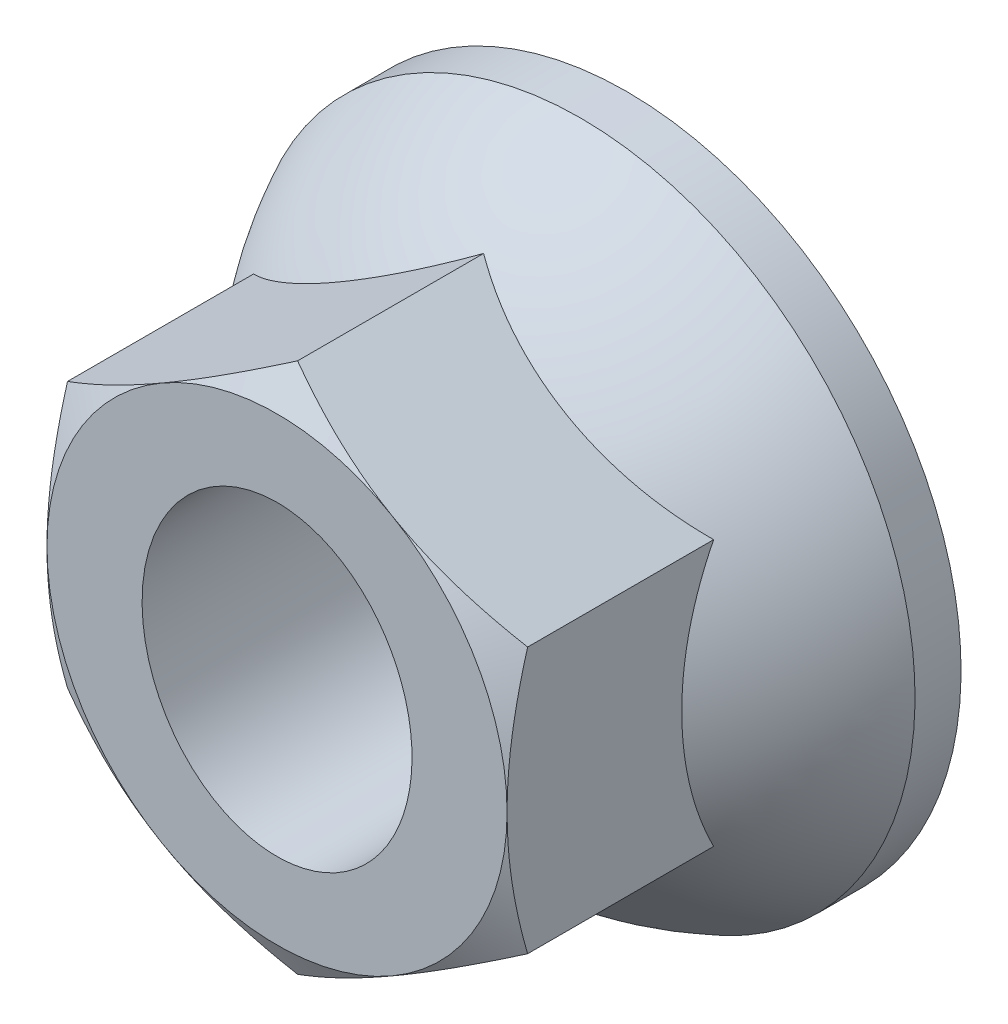
ISO-10303-21;
HEADER;
FILE_DESCRIPTION(('STEP AP214'),'2;1');
FILE_NAME('part.step','',(''),(''),'','','');
FILE_SCHEMA(('AUTOMOTIVE_DESIGN { 1 0 10303 214 1 1 1 1 }'));
ENDSEC;
DATA;
#1=APPLICATION_CONTEXT('core data for automotive mechanical design processes');
#2=APPLICATION_PROTOCOL_DEFINITION('international standard','automotive_design',2000,#1);
#3=PRODUCT_CONTEXT('',#1,'mechanical');
#4=PRODUCT('Part','Part','',(#3));
#5=PRODUCT_RELATED_PRODUCT_CATEGORY('part','',(#4));
#6=PRODUCT_DEFINITION_FORMATION('','',#4);
#7=PRODUCT_DEFINITION_CONTEXT('part definition',#1,'design');
#8=PRODUCT_DEFINITION('design','',#6,#7);
#9=PRODUCT_DEFINITION_SHAPE('','',#8);
#10=(LENGTH_UNIT() NAMED_UNIT(*) SI_UNIT(.MILLI.,.METRE.));
#11=(NAMED_UNIT(*) PLANE_ANGLE_UNIT() SI_UNIT($,.RADIAN.));
#12=(NAMED_UNIT(*) SI_UNIT($,.STERADIAN.) SOLID_ANGLE_UNIT());
#13=UNCERTAINTY_MEASURE_WITH_UNIT(LENGTH_MEASURE(1.E-05),#10,'distance_accuracy_value','');
#14=(GEOMETRIC_REPRESENTATION_CONTEXT(3) GLOBAL_UNCERTAINTY_ASSIGNED_CONTEXT((#13)) GLOBAL_UNIT_ASSIGNED_CONTEXT((#10,
#11,#12)) REPRESENTATION_CONTEXT('',''));
#15=CARTESIAN_POINT('',(0.,0.,0.));
#16=DIRECTION('',(0.,0.,1.));
#17=DIRECTION('',(1.,0.,0.));
#18=AXIS2_PLACEMENT_3D('',#15,#16,#17);
#19=CARTESIAN_POINT('',(7.5,-4.3301270189222,-5.7));
#20=DIRECTION('',(0.,0.,1.));
#21=DIRECTION('',(1.,0.,0.));
#22=AXIS2_PLACEMENT_3D('',#19,#20,#21);
#23=PLANE('',#22);
#24=CARTESIAN_POINT('',(0.,0.,-5.7));
#25=DIRECTION('',(0.,0.,-1.));
#26=DIRECTION('',(0.,1.,0.));
#27=AXIS2_PLACEMENT_3D('',#24,#25,#26);
#28=CIRCLE('',#27,10.9);
#29=CARTESIAN_POINT('',(0.,10.9,-5.7));
#30=VERTEX_POINT('',#29);
#31=EDGE_CURVE('E234',#30,#30,#28,.T.);
#32=ORIENTED_EDGE('',*,*,#31,.T.);
#33=EDGE_LOOP('',(#32));
#34=FACE_BOUND('',#33,.T.);
#35=CARTESIAN_POINT('',(0.,0.,-5.7));
#36=DIRECTION('',(0.,0.,1.));
#37=DIRECTION('',(0.,1.,0.));
#38=AXIS2_PLACEMENT_3D('',#35,#36,#37);
#39=ELLIPSE('',#38,5.,4.4);
#40=CARTESIAN_POINT('',(0.,5.,-5.7));
#41=VERTEX_POINT('',#40);
#42=EDGE_CURVE('E133',#41,#41,#39,.F.);
#43=ORIENTED_EDGE('',*,*,#42,.F.);
#44=EDGE_LOOP('',(#43));
#45=FACE_BOUND('',#44,.T.);
#46=ADVANCED_FACE('F38',(#34,#45),#23,.F.);
#47=CARTESIAN_POINT('',(7.5,-4.3301270189222,5.7));
#48=DIRECTION('',(0.,0.,1.));
#49=DIRECTION('',(1.,0.,0.));
#50=AXIS2_PLACEMENT_3D('',#47,#48,#49);
#51=PLANE('',#50);
#52=CARTESIAN_POINT('',(0.,0.,5.7));
#53=DIRECTION('',(0.,0.,1.));
#54=DIRECTION('',(1.,0.,0.));
#55=AXIS2_PLACEMENT_3D('',#52,#53,#54);
#56=CIRCLE('',#55,7.5);
#57=CARTESIAN_POINT('',(3.75,-6.49519052838329,5.7));
#58=VERTEX_POINT('',#57);
#59=CARTESIAN_POINT('',(7.5,0.,5.7));
#60=VERTEX_POINT('',#59);
#61=EDGE_CURVE('E43',#58,#60,#56,.T.);
#62=ORIENTED_EDGE('',*,*,#61,.T.);
#63=CARTESIAN_POINT('',(0.,0.,5.7));
#64=DIRECTION('',(0.,0.,1.));
#65=DIRECTION('',(1.,0.,0.));
#66=AXIS2_PLACEMENT_3D('',#63,#64,#65);
#67=CIRCLE('',#66,7.5);
#68=CARTESIAN_POINT('',(3.75,6.49519052838329,5.7));
#69=VERTEX_POINT('',#68);
#70=EDGE_CURVE('E55',#60,#69,#67,.T.);
#71=ORIENTED_EDGE('',*,*,#70,.T.);
#72=CARTESIAN_POINT('',(-3.75,6.49519052838329,5.7));
#73=VERTEX_POINT('',#72);
#74=EDGE_CURVE('E12',#69,#73,#56,.T.);
#75=ORIENTED_EDGE('',*,*,#74,.T.);
#76=CARTESIAN_POINT('',(-7.5,0.,5.7));
#77=VERTEX_POINT('',#76);
#78=EDGE_CURVE('E48',#73,#77,#56,.T.);
#79=ORIENTED_EDGE('',*,*,#78,.T.);
#80=CARTESIAN_POINT('',(-3.75,-6.49519052838329,5.7));
#81=VERTEX_POINT('',#80);
#82=EDGE_CURVE('E63',#77,#81,#56,.T.);
#83=ORIENTED_EDGE('',*,*,#82,.T.);
#84=EDGE_CURVE('E266',#81,#58,#56,.T.);
#85=ORIENTED_EDGE('',*,*,#84,.T.);
#86=EDGE_LOOP('',(#62,#71,#75,#79,#83,#85));
#87=FACE_BOUND('',#86,.T.);
#88=CARTESIAN_POINT('',(0.,0.,5.7));
#89=DIRECTION('',(0.,0.,1.));
#90=DIRECTION('',(0.,1.,0.));
#91=AXIS2_PLACEMENT_3D('',#88,#89,#90);
#92=ELLIPSE('',#91,5.,4.4);
#93=CARTESIAN_POINT('',(0.,5.,5.7));
#94=VERTEX_POINT('',#93);
#95=EDGE_CURVE('E398',#94,#94,#92,.T.);
#96=ORIENTED_EDGE('',*,*,#95,.F.);
#97=EDGE_LOOP('',(#96));
#98=FACE_BOUND('',#97,.T.);
#99=ADVANCED_FACE('F129',(#87,#98),#51,.T.);
#100=CARTESIAN_POINT('',(0.,-8.66025403784439,5.7));
#101=DIRECTION('',(-0.5,0.866025403784439,0.));
#102=DIRECTION('',(-0.866025403784439,-0.5,0.));
#103=AXIS2_PLACEMENT_3D('',#100,#101,#102);
#104=PLANE('',#103);
#105=CARTESIAN_POINT('',(3.75,-6.49519052838329,-9.5360294117647));
#106=DIRECTION('',(-0.5,0.866025403784439,0.));
#107=DIRECTION('',(-0.866025403784439,-0.5,0.));
#108=AXIS2_PLACEMENT_3D('',#105,#106,#107);
#109=CIRCLE('',#108,9.54113252623702);
#110=CARTESIAN_POINT('',(0.,-8.66025403784439,-1.0340761136562));
#111=VERTEX_POINT('',#110);
#112=CARTESIAN_POINT('',(7.5,-4.3301270189222,-1.03407611365621));
#113=VERTEX_POINT('',#112);
#114=EDGE_CURVE('E246',#111,#113,#109,.T.);
#115=ORIENTED_EDGE('',*,*,#114,.T.);
#116=DIRECTION('',(0.,0.,-1.));
#117=VECTOR('',#116,1.);
#118=CARTESIAN_POINT('',(7.5,-4.3301270189222,5.7));
#119=LINE('',#118,#117);
#120=CARTESIAN_POINT('',(7.5,-4.33012701892243,5.03012701892235));
#121=VERTEX_POINT('',#120);
#122=EDGE_CURVE('E260',#121,#113,#119,.T.);
#123=ORIENTED_EDGE('',*,*,#122,.F.);
#124=CARTESIAN_POINT('',(-0.000200000000000411,-8.66036950789822,5.03006035092221));
#125=CARTESIAN_POINT('',(0.164658347528303,-8.5651884965746,5.08500472895377));
#126=CARTESIAN_POINT('',(0.330131366574374,-8.46965260448473,5.13745551258067));
#127=CARTESIAN_POINT('',(0.662421221390856,-8.27780496735746,5.2366831074677));
#128=CARTESIAN_POINT('',(0.829238604021478,-8.18149290659016,5.28345747105412));
#129=CARTESIAN_POINT('',(1.33236168864788,-7.89101465824559,5.41434781674883));
#130=CARTESIAN_POINT('',(1.67065338263293,-7.69570185765871,5.48879669332343));
#131=CARTESIAN_POINT('',(2.17690074399285,-7.40341980730102,5.57609667073379));
#132=CARTESIAN_POINT('',(2.34334381202516,-7.30732385716782,5.60096588667846));
#133=CARTESIAN_POINT('',(2.67698200759169,-7.11469775514554,5.64266788572599));
#134=CARTESIAN_POINT('',(2.84417706735965,-7.01816764238133,5.65950137888585));
#135=CARTESIAN_POINT('',(3.17885756076865,-6.82493976941913,5.68470292592581));
#136=CARTESIAN_POINT('',(3.34634244781307,-6.72824232479884,5.69308058697982));
#137=CARTESIAN_POINT('',(3.68145767904924,-6.53476345583509,5.70119981902506));
#138=CARTESIAN_POINT('',(3.84908801858729,-6.43798203417845,5.70094165681687));
#139=CARTESIAN_POINT('',(4.30833780194545,-6.17283404813135,5.68836399486338));
#140=CARTESIAN_POINT('',(4.59980690473784,-6.0045542831737,5.66725033231931));
#141=CARTESIAN_POINT('',(5.18080920194341,-5.66911245048227,5.60029942126457));
#142=CARTESIAN_POINT('',(5.47034035314774,-5.50195156239567,5.55443929053726));
#143=CARTESIAN_POINT('',(6.05251186318613,-5.16583468436048,5.43980254355176));
#144=CARTESIAN_POINT('',(6.34507876500837,-4.99692110483743,5.37054023563082));
#145=CARTESIAN_POINT('',(6.92584963394653,-4.66161288731849,5.21334284742308));
#146=CARTESIAN_POINT('',(7.2140610384998,-4.49521395531614,5.1254446908316));
#147=CARTESIAN_POINT('',(7.5002,-4.33001154886836,5.03006035092221));
#148=B_SPLINE_CURVE_WITH_KNOTS('',3,(#124,#125,#126,#127,#128,#129,#130,#131,#132,#133,#134,
#135,#136,#137,#138,#139,#140,#141,#142,#143,#144,#145,#146,#147),.UNSPECIFIED.,.F.,.F.,(4,2,2,
2,2,2,2,2,2,2,2,4),(0.,0.594350768035413,1.1889569164522,2.38063993230779,2.96188692500078,
3.54308254771242,4.12361709366648,4.70413370423531,5.71473675578131,6.7262758828811,
7.7602492531408,8.79219281633469),.UNSPECIFIED.);
#149=EDGE_CURVE('E174',#58,#121,#148,.T.);
#150=ORIENTED_EDGE('',*,*,#149,.F.);
#151=CARTESIAN_POINT('',(0.,-8.66025403784439,5.0301270189222));
#152=VERTEX_POINT('',#151);
#153=EDGE_CURVE('E239',#152,#58,#148,.T.);
#154=ORIENTED_EDGE('',*,*,#153,.F.);
#155=DIRECTION('',(0.,0.,-1.));
#156=VECTOR('',#155,1.);
#157=CARTESIAN_POINT('',(0.,-8.66025403784439,5.7));
#158=LINE('',#157,#156);
#159=EDGE_CURVE('E248',#152,#111,#158,.T.);
#160=ORIENTED_EDGE('',*,*,#159,.T.);
#161=EDGE_LOOP('',(#115,#123,#150,#154,#160));
#162=FACE_BOUND('',#161,.T.);
#163=ADVANCED_FACE('F40',(#162),#104,.F.);
#164=CARTESIAN_POINT('',(7.5,-4.3301270189222,5.7));
#165=DIRECTION('',(-1.,0.,0.));
#166=DIRECTION('',(0.,-1.,0.));
#167=AXIS2_PLACEMENT_3D('',#164,#165,#166);
#168=PLANE('',#167);
#169=CARTESIAN_POINT('',(7.5,0.,-9.5360294117647));
#170=DIRECTION('',(-1.,0.,0.));
#171=DIRECTION('',(0.,-1.,0.));
#172=AXIS2_PLACEMENT_3D('',#169,#170,#171);
#173=CIRCLE('',#172,9.54113252623702);
#174=CARTESIAN_POINT('',(7.5,4.3301270189222,-1.0340761136562));
#175=VERTEX_POINT('',#174);
#176=EDGE_CURVE('E244',#113,#175,#173,.T.);
#177=ORIENTED_EDGE('',*,*,#176,.T.);
#178=DIRECTION('',(0.,0.,-1.));
#179=VECTOR('',#178,1.);
#180=CARTESIAN_POINT('',(7.5,4.3301270189222,5.7));
#181=LINE('',#180,#179);
#182=CARTESIAN_POINT('',(7.5,4.3301270189222,5.03012701892219));
#183=VERTEX_POINT('',#182);
#184=EDGE_CURVE('E258',#183,#175,#181,.T.);
#185=ORIENTED_EDGE('',*,*,#184,.F.);
#186=CARTESIAN_POINT('',(7.5,-11.8624678338848,1.92728506666141));
#187=CARTESIAN_POINT('',(7.5,-11.5328457376214,2.08809744117027));
#188=CARTESIAN_POINT('',(7.5,-11.2024912853407,2.24743321529681));
#189=CARTESIAN_POINT('',(7.5,-10.5399289565581,2.56232533562342));
#190=CARTESIAN_POINT('',(7.5,-10.2077208171779,2.717881128111));
#191=CARTESIAN_POINT('',(7.5,-9.53945946788294,3.02512073818121));
#192=CARTESIAN_POINT('',(7.5,-9.20339529022096,3.17678077913414));
#193=CARTESIAN_POINT('',(7.5,-8.52867329930982,3.47419467429847));
#194=CARTESIAN_POINT('',(7.5,-8.19001560305681,3.61994879308739));
#195=CARTESIAN_POINT('',(7.5,-7.49786360718472,3.90888491917955));
#196=CARTESIAN_POINT('',(7.5,-7.14425974861481,4.05180586766548));
#197=CARTESIAN_POINT('',(7.5,-6.43300236260634,4.32738020491684));
#198=CARTESIAN_POINT('',(7.5,-6.07534839863684,4.46003247458771));
#199=CARTESIAN_POINT('',(7.5,-5.3560150262996,4.71175565610245));
#200=CARTESIAN_POINT('',(7.5,-4.99434466734429,4.83085216023722));
#201=CARTESIAN_POINT('',(7.5,-4.26583379083137,5.05179729592312));
#202=CARTESIAN_POINT('',(7.5,-3.8989948659867,5.15365112017604));
#203=CARTESIAN_POINT('',(7.5,-3.16192086951898,5.33482975886738));
#204=CARTESIAN_POINT('',(7.5,-2.79171811431998,5.41428259020064));
#205=CARTESIAN_POINT('',(7.5,-2.23286584461635,5.51333570146998));
#206=CARTESIAN_POINT('',(7.5,-2.04597858174939,5.5430002768522));
#207=CARTESIAN_POINT('',(7.5,-1.67119867125142,5.59504538851882));
#208=CARTESIAN_POINT('',(7.5,-1.4833061232766,5.61742663369904));
#209=CARTESIAN_POINT('',(7.5,-1.10932231055302,5.65416584975736));
#210=CARTESIAN_POINT('',(7.5,-0.923241432591073,5.6686290917487));
#211=CARTESIAN_POINT('',(7.5,-0.550634001123204,5.6896652282327));
#212=CARTESIAN_POINT('',(7.5,-0.364107455445952,5.69623826031976));
#213=CARTESIAN_POINT('',(7.5,0.00905823476357524,5.70133605454041));
#214=CARTESIAN_POINT('',(7.5,0.195697379759309,5.69986078331806));
#215=CARTESIAN_POINT('',(7.5,0.568742366438614,5.6889003395425));
#216=CARTESIAN_POINT('',(7.5,0.755148197384577,5.67941481099973));
#217=CARTESIAN_POINT('',(7.5,1.19625328292009,5.64769661141222));
#218=CARTESIAN_POINT('',(7.5,1.45071264523352,5.62204693053427));
#219=CARTESIAN_POINT('',(7.5,1.95788025873181,5.55716915064197));
#220=CARTESIAN_POINT('',(7.5,2.21058829297697,5.51793939905958));
#221=CARTESIAN_POINT('',(7.5,2.96571213846647,5.38194915581682));
#222=CARTESIAN_POINT('',(7.5,3.46488700839563,5.26690739114848));
#223=CARTESIAN_POINT('',(7.5,4.21175910897805,5.06562643164791));
#224=CARTESIAN_POINT('',(7.5,4.46327798189274,4.99273656829492));
#225=CARTESIAN_POINT('',(7.5,4.96387757889623,4.83894210496991));
#226=CARTESIAN_POINT('',(7.5,5.21295828362573,4.75803744141614));
#227=CARTESIAN_POINT('',(7.5,5.70875452435172,4.58954791755454));
#228=CARTESIAN_POINT('',(7.5,5.9554706741828,4.50196484690174));
#229=CARTESIAN_POINT('',(7.5,6.44682677730069,4.32119315346525));
#230=CARTESIAN_POINT('',(7.5,6.69146678230042,4.2280046707724));
#231=CARTESIAN_POINT('',(7.5,7.36246161814329,3.9650046907528));
#232=CARTESIAN_POINT('',(7.5,7.78691341159853,3.79034201244135));
#233=CARTESIAN_POINT('',(7.5,8.63131442401152,3.4304130048731));
#234=CARTESIAN_POINT('',(7.5,9.05126308940821,3.24514538931825));
#235=CARTESIAN_POINT('',(7.5,9.88771968583189,2.86657146619056));
#236=CARTESIAN_POINT('',(7.5,10.304226109548,2.67326183973855));
#237=CARTESIAN_POINT('',(7.5,11.1343338845794,2.28057132688068));
#238=CARTESIAN_POINT('',(7.5,11.5479353653164,2.08119071308959));
#239=CARTESIAN_POINT('',(7.5,12.373526814919,1.67736246439331));
#240=CARTESIAN_POINT('',(7.5,12.7855128308024,1.47290676546053));
#241=CARTESIAN_POINT('',(7.5,13.6076089200337,1.06025514091654));
#242=CARTESIAN_POINT('',(7.5,14.0177189760598,0.852059180856811));
#243=CARTESIAN_POINT('',(7.5,14.8363060491096,0.432725398715312));
#244=CARTESIAN_POINT('',(7.5,15.2447834348064,0.221588295448026));
#245=CARTESIAN_POINT('',(7.5,16.0604733961248,-0.203116490819916));
#246=CARTESIAN_POINT('',(7.5,16.4676859666126,-0.416684183669698));
#247=CARTESIAN_POINT('',(7.5,17.5987846667367,-1.01342749216833));
#248=CARTESIAN_POINT('',(7.5,18.3215327410963,-1.39875974788874));
#249=CARTESIAN_POINT('',(7.5,19.7646347588531,-2.17398683391115));
#250=CARTESIAN_POINT('',(7.5,20.484988537998,-2.56388196926437));
#251=CARTESIAN_POINT('',(7.5,21.9213150399891,-3.34568354245719));
#252=CARTESIAN_POINT('',(7.5,22.6372942568684,-3.73757805709041));
#253=CARTESIAN_POINT('',(7.5,23.7101694591332,-4.32733624897439));
#254=CARTESIAN_POINT('',(7.5,24.0675973985926,-4.52423347927221));
#255=CARTESIAN_POINT('',(7.5,24.7821368856686,-4.91860011589127));
#256=CARTESIAN_POINT('',(7.5,25.1392484337073,-5.1160695214475));
#257=CARTESIAN_POINT('',(7.5,25.4962213463683,-5.31378928845083));
#258=B_SPLINE_CURVE_WITH_KNOTS('',3,(#186,#187,#188,#189,#190,#191,#192,#193,#194,#195,#196,
#197,#198,#199,#200,#201,#202,#203,#204,#205,#206,#207,#208,#209,#210,#211,#212,#213,#214,#215,
#216,#217,#218,#219,#220,#221,#222,#223,#224,#225,#226,#227,#228,#229,#230,#231,#232,#233,#234,
#235,#236,#237,#238,#239,#240,#241,#242,#243,#244,#245,#246,#247,#248,#249,#250,#251,#252,#253,
#254,#255,#256,#257),.UNSPECIFIED.,.F.,.F.,(4,2,2,2,2,2,2,2,2,2,2,2,2,2,2,2,2,2,2,2,2,2,2,2,2,2,
2,2,2,2,2,2,2,2,2,4),(0.,1.1002860174317,2.20073225087718,3.30678744386493,4.41279303213297,
5.55685386575428,6.70103920565941,7.84302726390369,8.98467079371612,10.1196513376086,
10.68721271233,11.2547188290465,11.8144843404463,12.3742400901626,12.9339981597705,
13.4937811072962,14.260599324346,15.0275108888493,16.5620551990661,17.3475860316543,
18.1331230963895,18.9184503906132,19.7037580660324,21.0804916441742,22.4573925649098,
23.834867471808,25.2122806148121,26.5920436164986,27.9718193325907,29.3512635507415,
30.7307133606056,33.1878429886977,35.6451378373834,38.0937765695139,39.3179940081302,
40.5422098106952),.UNSPECIFIED.);
#259=EDGE_CURVE('E115',#60,#183,#258,.T.);
#260=ORIENTED_EDGE('',*,*,#259,.F.);
#261=EDGE_CURVE('E281',#121,#60,#258,.T.);
#262=ORIENTED_EDGE('',*,*,#261,.F.);
#263=ORIENTED_EDGE('',*,*,#122,.T.);
#264=EDGE_LOOP('',(#177,#185,#260,#262,#263));
#265=FACE_BOUND('',#264,.T.);
#266=ADVANCED_FACE('F211',(#265),#168,.F.);
#267=CARTESIAN_POINT('',(7.5,4.3301270189222,5.7));
#268=DIRECTION('',(-0.5,-0.866025403784438,0.));
#269=DIRECTION('',(0.866025403784439,-0.5,0.));
#270=AXIS2_PLACEMENT_3D('',#267,#268,#269);
#271=PLANE('',#270);
#272=CARTESIAN_POINT('',(3.75,6.49519052838329,-9.5360294117647));
#273=DIRECTION('',(-0.5,-0.866025403784438,0.));
#274=DIRECTION('',(0.866025403784439,-0.5,0.));
#275=AXIS2_PLACEMENT_3D('',#272,#273,#274);
#276=CIRCLE('',#275,9.54113252623702);
#277=CARTESIAN_POINT('',(0.,8.66025403784439,-1.0340761136562));
#278=VERTEX_POINT('',#277);
#279=EDGE_CURVE('E242',#175,#278,#276,.T.);
#280=ORIENTED_EDGE('',*,*,#279,.T.);
#281=DIRECTION('',(0.,0.,-1.));
#282=VECTOR('',#281,1.);
#283=CARTESIAN_POINT('',(0.,8.66025403784439,5.7));
#284=LINE('',#283,#282);
#285=CARTESIAN_POINT('',(0.,8.66025403784439,5.03012701892219));
#286=VERTEX_POINT('',#285);
#287=EDGE_CURVE('E138',#286,#278,#284,.T.);
#288=ORIENTED_EDGE('',*,*,#287,.F.);
#289=CARTESIAN_POINT('',(7.5002,4.33001154886836,5.03006035092221));
#290=CARTESIAN_POINT('',(7.33534165247169,4.42519256019198,5.08500472895377));
#291=CARTESIAN_POINT('',(7.16986863342562,4.52072845228185,5.13745551258067));
#292=CARTESIAN_POINT('',(6.83757877860914,4.71257608940913,5.2366831074677));
#293=CARTESIAN_POINT('',(6.67076139597852,4.80888815017643,5.28345747105412));
#294=CARTESIAN_POINT('',(6.16763831135212,5.09936639852099,5.41434781674883));
#295=CARTESIAN_POINT('',(5.82934661736707,5.29467919910788,5.48879669332343));
#296=CARTESIAN_POINT('',(5.32309925600715,5.58696124946557,5.57609667073378));
#297=CARTESIAN_POINT('',(5.15665618797484,5.68305719959877,5.60096588667846));
#298=CARTESIAN_POINT('',(4.8230179924083,5.87568330162105,5.64266788572599));
#299=CARTESIAN_POINT('',(4.65582293264035,5.97221341438525,5.65950137888585));
#300=CARTESIAN_POINT('',(4.32114243923135,6.16544128734746,5.6847029259258));
#301=CARTESIAN_POINT('',(4.15365755218693,6.26213873196775,5.69308058697982));
#302=CARTESIAN_POINT('',(3.81854232095076,6.45561760093149,5.70119981902505));
#303=CARTESIAN_POINT('',(3.65091198141271,6.55239902258814,5.70094165681687));
#304=CARTESIAN_POINT('',(3.19166219805455,6.81754700863524,5.68836399486338));
#305=CARTESIAN_POINT('',(2.90019309526215,6.98582677359289,5.66725033231931));
#306=CARTESIAN_POINT('',(2.31919079805659,7.32126860628432,5.60029942126456));
#307=CARTESIAN_POINT('',(2.02965964685226,7.48842949437092,5.55443929053725));
#308=CARTESIAN_POINT('',(1.44748813681387,7.82454637240611,5.43980254355176));
#309=CARTESIAN_POINT('',(1.15492123499162,7.99345995192916,5.37054023563082));
#310=CARTESIAN_POINT('',(0.574150366053471,8.3287681694481,5.21334284742308));
#311=CARTESIAN_POINT('',(0.285938961500197,8.49516710145045,5.1254446908316));
#312=CARTESIAN_POINT('',(-0.000199999999999066,8.66036950789823,5.03006035092221));
#313=B_SPLINE_CURVE_WITH_KNOTS('',3,(#289,#290,#291,#292,#293,#294,#295,#296,#297,#298,#299,
#300,#301,#302,#303,#304,#305,#306,#307,#308,#309,#310,#311,#312),.UNSPECIFIED.,.F.,.F.,(4,2,2,
2,2,2,2,2,2,2,2,4),(0.,0.594350768035412,1.1889569164522,2.38063993230779,2.96188692500078,
3.54308254771242,4.12361709366648,4.70413370423531,5.71473675578131,6.7262758828811,
7.7602492531408,8.79219281633469),.UNSPECIFIED.);
#314=EDGE_CURVE('E120',#69,#286,#313,.T.);
#315=ORIENTED_EDGE('',*,*,#314,.F.);
#316=EDGE_CURVE('E111',#183,#69,#313,.T.);
#317=ORIENTED_EDGE('',*,*,#316,.F.);
#318=ORIENTED_EDGE('',*,*,#184,.T.);
#319=EDGE_LOOP('',(#280,#288,#315,#317,#318));
#320=FACE_BOUND('',#319,.T.);
#321=ADVANCED_FACE('F136',(#320),#271,.F.);
#322=CARTESIAN_POINT('',(0.,8.66025403784439,5.7));
#323=DIRECTION('',(0.5,-0.866025403784439,0.));
#324=DIRECTION('',(0.866025403784439,0.5,0.));
#325=AXIS2_PLACEMENT_3D('',#322,#323,#324);
#326=PLANE('',#325);
#327=CARTESIAN_POINT('',(-3.75,6.49519052838329,-9.5360294117647));
#328=DIRECTION('',(0.5,-0.866025403784439,0.));
#329=DIRECTION('',(0.866025403784439,0.5,0.));
#330=AXIS2_PLACEMENT_3D('',#327,#328,#329);
#331=CIRCLE('',#330,9.54113252623702);
#332=CARTESIAN_POINT('',(-7.5,4.3301270189222,-1.03407611365621));
#333=VERTEX_POINT('',#332);
#334=EDGE_CURVE('E237',#278,#333,#331,.T.);
#335=ORIENTED_EDGE('',*,*,#334,.T.);
#336=DIRECTION('',(0.,0.,-1.));
#337=VECTOR('',#336,1.);
#338=CARTESIAN_POINT('',(-7.5,4.3301270189222,5.7));
#339=LINE('',#338,#337);
#340=CARTESIAN_POINT('',(-7.5,4.3301270189222,5.03012701892219));
#341=VERTEX_POINT('',#340);
#342=EDGE_CURVE('E254',#341,#333,#339,.T.);
#343=ORIENTED_EDGE('',*,*,#342,.F.);
#344=CARTESIAN_POINT('',(0.000200000000000658,8.66036950789823,5.03006035092221));
#345=CARTESIAN_POINT('',(-0.164658347528303,8.56518849657461,5.08500472895376));
#346=CARTESIAN_POINT('',(-0.330131366574374,8.46965260448474,5.13745551258067));
#347=CARTESIAN_POINT('',(-0.662421221390856,8.27780496735746,5.2366831074677));
#348=CARTESIAN_POINT('',(-0.829238604021478,8.18149290659016,5.28345747105412));
#349=CARTESIAN_POINT('',(-1.33236168864788,7.89101465824559,5.41434781674883));
#350=CARTESIAN_POINT('',(-1.67065338263293,7.69570185765871,5.48879669332342));
#351=CARTESIAN_POINT('',(-2.17690074399285,7.40341980730102,5.57609667073378));
#352=CARTESIAN_POINT('',(-2.34334381202516,7.30732385716782,5.60096588667846));
#353=CARTESIAN_POINT('',(-2.6769820075917,7.11469775514554,5.64266788572599));
#354=CARTESIAN_POINT('',(-2.84417706735965,7.01816764238133,5.65950137888585));
#355=CARTESIAN_POINT('',(-3.17885756076865,6.82493976941913,5.6847029259258));
#356=CARTESIAN_POINT('',(-3.34634244781307,6.72824232479884,5.69308058697982));
#357=CARTESIAN_POINT('',(-3.68145767904925,6.53476345583509,5.70119981902505));
#358=CARTESIAN_POINT('',(-3.8490880185873,6.43798203417845,5.70094165681687));
#359=CARTESIAN_POINT('',(-4.30833780194545,6.17283404813135,5.68836399486338));
#360=CARTESIAN_POINT('',(-4.59980690473785,6.0045542831737,5.66725033231931));
#361=CARTESIAN_POINT('',(-5.18080920194341,5.66911245048227,5.60029942126456));
#362=CARTESIAN_POINT('',(-5.47034035314774,5.50195156239567,5.55443929053726));
#363=CARTESIAN_POINT('',(-6.05251186318613,5.16583468436048,5.43980254355176));
#364=CARTESIAN_POINT('',(-6.34507876500838,4.99692110483743,5.37054023563082));
#365=CARTESIAN_POINT('',(-6.92584963394653,4.66161288731849,5.21334284742308));
#366=CARTESIAN_POINT('',(-7.21406103849981,4.49521395531614,5.1254446908316));
#367=CARTESIAN_POINT('',(-7.5002,4.33001154886836,5.03006035092221));
#368=B_SPLINE_CURVE_WITH_KNOTS('',3,(#344,#345,#346,#347,#348,#349,#350,#351,#352,#353,#354,
#355,#356,#357,#358,#359,#360,#361,#362,#363,#364,#365,#366,#367),.UNSPECIFIED.,.F.,.F.,(4,2,2,
2,2,2,2,2,2,2,2,4),(0.,0.594350768035413,1.1889569164522,2.38063993230779,2.96188692500079,
3.54308254771242,4.12361709366648,4.70413370423532,5.71473675578131,6.72627588288111,
7.7602492531408,8.7921928163347),.UNSPECIFIED.);
#369=EDGE_CURVE('E139',#73,#341,#368,.T.);
#370=ORIENTED_EDGE('',*,*,#369,.F.);
#371=EDGE_CURVE('E125',#286,#73,#368,.T.);
#372=ORIENTED_EDGE('',*,*,#371,.F.);
#373=ORIENTED_EDGE('',*,*,#287,.T.);
#374=EDGE_LOOP('',(#335,#343,#370,#372,#373));
#375=FACE_BOUND('',#374,.T.);
#376=ADVANCED_FACE('F201',(#375),#326,.F.);
#377=CARTESIAN_POINT('',(-7.5,4.3301270189222,5.7));
#378=DIRECTION('',(1.,0.,0.));
#379=DIRECTION('',(0.,1.,0.));
#380=AXIS2_PLACEMENT_3D('',#377,#378,#379);
#381=PLANE('',#380);
#382=CARTESIAN_POINT('',(-7.5,0.,-9.5360294117647));
#383=DIRECTION('',(1.,0.,0.));
#384=DIRECTION('',(0.,1.,0.));
#385=AXIS2_PLACEMENT_3D('',#382,#383,#384);
#386=CIRCLE('',#385,9.54113252623702);
#387=CARTESIAN_POINT('',(-7.5,-4.33012701892219,-1.0340761136562));
#388=VERTEX_POINT('',#387);
#389=EDGE_CURVE('E235',#333,#388,#386,.T.);
#390=ORIENTED_EDGE('',*,*,#389,.T.);
#391=DIRECTION('',(0.,0.,-1.));
#392=VECTOR('',#391,1.);
#393=CARTESIAN_POINT('',(-7.5,-4.33012701892219,5.7));
#394=LINE('',#393,#392);
#395=CARTESIAN_POINT('',(-7.5,-4.33012701892219,5.0301270189222));
#396=VERTEX_POINT('',#395);
#397=EDGE_CURVE('E251',#396,#388,#394,.T.);
#398=ORIENTED_EDGE('',*,*,#397,.F.);
#399=CARTESIAN_POINT('',(-7.5,-11.862467820225,1.92728507332735));
#400=CARTESIAN_POINT('',(-7.5,-11.5328457244217,2.08809744755884));
#401=CARTESIAN_POINT('',(-7.5,-11.2024912726016,2.24743322140818));
#402=CARTESIAN_POINT('',(-7.5,-10.5399289447413,2.56232534118173));
#403=CARTESIAN_POINT('',(-7.5,-10.207720805823,2.71788113339346));
#404=CARTESIAN_POINT('',(-7.5,-9.53945945745855,3.02512074291186));
#405=CARTESIAN_POINT('',(-7.5,-9.2033952802653,3.17678078358888));
#406=CARTESIAN_POINT('',(-7.5,-8.52867329029471,3.47419467820588));
#407=CARTESIAN_POINT('',(-7.5,-8.19001559451354,3.61994879672339));
#408=CARTESIAN_POINT('',(-7.5,-7.49786359962345,3.90888492226387));
#409=CARTESIAN_POINT('',(-7.5,-7.14425974156405,4.05180587047018));
#410=CARTESIAN_POINT('',(-7.5,-6.43300235658466,4.32738020717698));
#411=CARTESIAN_POINT('',(-7.5,-6.07534839313372,4.4600324765829));
#412=CARTESIAN_POINT('',(-7.5,-5.3560150218432,4.71175565759262));
#413=CARTESIAN_POINT('',(-7.5,-4.99434466341599,4.83085216148725));
#414=CARTESIAN_POINT('',(-7.5,-4.26583378797344,5.05179729673126));
#415=CARTESIAN_POINT('',(-7.5,-3.89899486367104,5.15365112078242));
#416=CARTESIAN_POINT('',(-7.5,-3.16192086856146,5.33482975906587));
#417=CARTESIAN_POINT('',(-7.5,-2.79171811418211,5.41428259020799));
#418=CARTESIAN_POINT('',(-7.5,-2.23286584572282,5.51333570128242));
#419=CARTESIAN_POINT('',(-7.5,-2.04597858327297,5.54300027661497));
#420=CARTESIAN_POINT('',(-7.5,-1.67119867361294,5.5950453882165));
#421=CARTESIAN_POINT('',(-7.5,-1.48330612605894,5.61742663338127));
#422=CARTESIAN_POINT('',(-7.5,-1.10932231416822,5.65416584944604));
#423=CARTESIAN_POINT('',(-7.5,-0.92324143661827,5.66862909145858));
#424=CARTESIAN_POINT('',(-7.5,-0.550634005973816,5.68966522802159));
#425=CARTESIAN_POINT('',(-7.5,-0.36410746070798,5.69623826016647));
#426=CARTESIAN_POINT('',(-7.5,0.00905822868163295,5.70133605453872));
#427=CARTESIAN_POINT('',(-7.5,0.195697373268869,5.69986078341015));
#428=CARTESIAN_POINT('',(-7.5,0.568742359136386,5.68890033985571));
#429=CARTESIAN_POINT('',(-7.5,0.755148189679059,5.67941481144028));
#430=CARTESIAN_POINT('',(-7.5,1.19625327460029,5.64769661216577));
#431=CARTESIAN_POINT('',(-7.5,1.45071263670444,5.62204693146733));
#432=CARTESIAN_POINT('',(-7.5,1.95788024979389,5.55716915194355));
#433=CARTESIAN_POINT('',(-7.5,2.2105882838395,5.51793940055015));
#434=CARTESIAN_POINT('',(-7.5,2.96571212874157,5.38194915787817));
#435=CARTESIAN_POINT('',(-7.5,3.46488699829507,5.26690739359514));
#436=CARTESIAN_POINT('',(-7.5,4.21175909831572,5.0656264346626));
#437=CARTESIAN_POINT('',(-7.5,4.46327797103896,4.99273657150025));
#438=CARTESIAN_POINT('',(-7.5,4.96387756766185,4.83894210855042));
#439=CARTESIAN_POINT('',(-7.5,5.21295827220219,4.7580374451812));
#440=CARTESIAN_POINT('',(-7.5,5.70875451255134,4.58954792168185));
#441=CARTESIAN_POINT('',(-7.5,5.95547066219475,4.50196485120671));
#442=CARTESIAN_POINT('',(-7.5,6.44682676493727,4.32119315811912));
#443=CARTESIAN_POINT('',(-7.5,6.69146676974932,4.22800467559751));
#444=CARTESIAN_POINT('',(-7.5,7.3624616054912,3.96500469587796));
#445=CARTESIAN_POINT('',(-7.5,7.78691339902714,3.7903420176752));
#446=CARTESIAN_POINT('',(-7.5,8.63131441159092,3.43041301029191));
#447=CARTESIAN_POINT('',(-7.5,9.05126307705771,3.24514539481333));
#448=CARTESIAN_POINT('',(-7.5,9.88771967361411,2.86657147181488));
#449=CARTESIAN_POINT('',(-7.5,10.3042260973928,2.67326184541582));
#450=CARTESIAN_POINT('',(-7.5,11.1343338725426,2.28057133264758));
#451=CARTESIAN_POINT('',(-7.5,11.5479353533354,2.08119071889319));
#452=CARTESIAN_POINT('',(-7.5,12.373526803048,1.67736247025671));
#453=CARTESIAN_POINT('',(-7.5,12.7855128189858,1.47290677134699));
#454=CARTESIAN_POINT('',(-7.5,13.6076089083216,1.0602551468403));
#455=CARTESIAN_POINT('',(-7.5,14.0177189643981,0.852059186794806));
#456=CARTESIAN_POINT('',(-7.5,14.8363060375447,0.432725404675496));
#457=CARTESIAN_POINT('',(-7.5,15.2447834232881,0.221588301416168));
#458=CARTESIAN_POINT('',(-7.5,16.0604733846972,-0.203116484840879));
#459=CARTESIAN_POINT('',(-7.5,16.4676859552291,-0.416684177687723));
#460=CARTESIAN_POINT('',(-7.5,17.5987846553985,-1.01342748614406));
#461=CARTESIAN_POINT('',(-7.5,18.3215327297574,-1.39875974182863));
#462=CARTESIAN_POINT('',(-7.5,19.7646347475097,-2.17398682778663));
#463=CARTESIAN_POINT('',(-7.5,20.4849885266507,-2.56388196311128));
#464=CARTESIAN_POINT('',(-7.5,21.9213150286184,-3.34568353624482));
#465=CARTESIAN_POINT('',(-7.5,22.6372942454783,-3.73757805084726));
#466=CARTESIAN_POINT('',(-7.5,23.7101694477124,-4.32733624268747));
#467=CARTESIAN_POINT('',(-7.5,24.0675973871613,-4.52423347297106));
#468=CARTESIAN_POINT('',(-7.5,24.7821368742159,-4.91860010956236));
#469=CARTESIAN_POINT('',(-7.5,25.1392484222437,-5.11606951510506));
#470=CARTESIAN_POINT('',(-7.5,25.4962213348936,-5.31378928209517));
#471=B_SPLINE_CURVE_WITH_KNOTS('',3,(#399,#400,#401,#402,#403,#404,#405,#406,#407,#408,#409,
#410,#411,#412,#413,#414,#415,#416,#417,#418,#419,#420,#421,#422,#423,#424,#425,#426,#427,#428,
#429,#430,#431,#432,#433,#434,#435,#436,#437,#438,#439,#440,#441,#442,#443,#444,#445,#446,#447,
#448,#449,#450,#451,#452,#453,#454,#455,#456,#457,#458,#459,#460,#461,#462,#463,#464,#465,#466,
#467,#468,#469,#470),.UNSPECIFIED.,.F.,.F.,(4,2,2,2,2,2,2,2,2,2,2,2,2,2,2,2,2,2,2,2,2,2,2,2,2,2,
2,2,2,2,2,2,2,2,2,4),(0.,1.10028601582613,2.20073224766582,3.30678743903139,4.41279302567738,
5.55685385756457,6.70103919573501,7.84302725225005,8.98467078033459,10.1196513217086,
10.6872126951716,11.2547188106302,11.8144843208038,12.3742400692938,12.9339981376752,
13.4937810839742,14.2605993003457,15.0275108641706,16.5620551730276,17.3475860049047,
18.1331230689288,18.9184503624434,19.7037580371534,21.0804916153937,22.4573925362288,
23.8348674432301,25.2122805863369,26.5920435881384,27.9718193043458,29.3512635226096,
30.7307133325868,33.1878429606267,35.6451378092612,38.0937765412962,39.3179939798642,
40.5422097823809),.UNSPECIFIED.);
#472=EDGE_CURVE('E189',#77,#396,#471,.F.);
#473=ORIENTED_EDGE('',*,*,#472,.F.);
#474=EDGE_CURVE('E195',#341,#77,#471,.F.);
#475=ORIENTED_EDGE('',*,*,#474,.F.);
#476=ORIENTED_EDGE('',*,*,#342,.T.);
#477=EDGE_LOOP('',(#390,#398,#473,#475,#476));
#478=FACE_BOUND('',#477,.T.);
#479=ADVANCED_FACE('F197',(#478),#381,.F.);
#480=CARTESIAN_POINT('',(-7.5,-4.33012701892219,5.7));
#481=DIRECTION('',(0.5,0.866025403784439,0.));
#482=DIRECTION('',(-0.866025403784439,0.5,0.));
#483=AXIS2_PLACEMENT_3D('',#480,#481,#482);
#484=PLANE('',#483);
#485=CARTESIAN_POINT('',(-3.75,-6.49519052838329,-9.5360294117647));
#486=DIRECTION('',(0.5,0.866025403784439,0.));
#487=DIRECTION('',(-0.866025403784439,0.5,0.));
#488=AXIS2_PLACEMENT_3D('',#485,#486,#487);
#489=CIRCLE('',#488,9.54113252623702);
#490=EDGE_CURVE('E262',#388,#111,#489,.T.);
#491=ORIENTED_EDGE('',*,*,#490,.T.);
#492=ORIENTED_EDGE('',*,*,#159,.F.);
#493=CARTESIAN_POINT('',(-7.5002,-4.33001154886835,5.03006035092221));
#494=CARTESIAN_POINT('',(-7.3353416524717,-4.42519256019198,5.08500472895377));
#495=CARTESIAN_POINT('',(-7.16986863342563,-4.52072845228185,5.13745551258067));
#496=CARTESIAN_POINT('',(-6.83757877860914,-4.71257608940912,5.2366831074677));
#497=CARTESIAN_POINT('',(-6.67076139597852,-4.80888815017642,5.28345747105412));
#498=CARTESIAN_POINT('',(-6.16763831135212,-5.09936639852099,5.41434781674883));
#499=CARTESIAN_POINT('',(-5.82934661736707,-5.29467919910787,5.48879669332343));
#500=CARTESIAN_POINT('',(-5.32309925600715,-5.58696124946556,5.57609667073379));
#501=CARTESIAN_POINT('',(-5.15665618797484,-5.68305719959876,5.60096588667846));
#502=CARTESIAN_POINT('',(-4.82301799240831,-5.87568330162104,5.64266788572599));
#503=CARTESIAN_POINT('',(-4.65582293264035,-5.97221341438525,5.65950137888585));
#504=CARTESIAN_POINT('',(-4.32114243923135,-6.16544128734745,5.68470292592581));
#505=CARTESIAN_POINT('',(-4.15365755218693,-6.26213873196774,5.69308058697982));
#506=CARTESIAN_POINT('',(-3.81854232095076,-6.45561760093149,5.70119981902506));
#507=CARTESIAN_POINT('',(-3.65091198141271,-6.55239902258813,5.70094165681687));
#508=CARTESIAN_POINT('',(-3.19166219805456,-6.81754700863523,5.68836399486338));
#509=CARTESIAN_POINT('',(-2.90019309526216,-6.98582677359289,5.66725033231931));
#510=CARTESIAN_POINT('',(-2.31919079805659,-7.32126860628431,5.60029942126457));
#511=CARTESIAN_POINT('',(-2.02965964685226,-7.48842949437091,5.55443929053726));
#512=CARTESIAN_POINT('',(-1.44748813681388,-7.8245463724061,5.43980254355176));
#513=CARTESIAN_POINT('',(-1.15492123499163,-7.99345995192915,5.37054023563082));
#514=CARTESIAN_POINT('',(-0.574150366053472,-8.32876816944809,5.21334284742308));
#515=CARTESIAN_POINT('',(-0.285938961500196,-8.49516710145044,5.1254446908316));
#516=CARTESIAN_POINT('',(0.000199999999998852,-8.66036950789822,5.03006035092221));
#517=B_SPLINE_CURVE_WITH_KNOTS('',3,(#493,#494,#495,#496,#497,#498,#499,#500,#501,#502,#503,
#504,#505,#506,#507,#508,#509,#510,#511,#512,#513,#514,#515,#516),.UNSPECIFIED.,.F.,.F.,(4,2,2,
2,2,2,2,2,2,2,2,4),(0.,0.594350768035413,1.1889569164522,2.38063993230779,2.96188692500079,
3.54308254771242,4.12361709366648,4.70413370423531,5.71473675578131,6.7262758828811,
7.7602492531408,8.79219281633469),.UNSPECIFIED.);
#518=EDGE_CURVE('E132',#81,#152,#517,.T.);
#519=ORIENTED_EDGE('',*,*,#518,.F.);
#520=EDGE_CURVE('E196',#396,#81,#517,.T.);
#521=ORIENTED_EDGE('',*,*,#520,.F.);
#522=ORIENTED_EDGE('',*,*,#397,.T.);
#523=EDGE_LOOP('',(#491,#492,#519,#521,#522));
#524=FACE_BOUND('',#523,.T.);
#525=ADVANCED_FACE('F200',(#524),#484,.F.);
#526=CARTESIAN_POINT('',(0.,0.,-9.5360294117647));
#527=DIRECTION('',(0.,0.,-1.));
#528=DIRECTION('',(0.,1.,0.));
#529=AXIS2_PLACEMENT_3D('',#526,#527,#528);
#530=SPHERICAL_SURFACE('',#529,12.1360294117647);
#531=CARTESIAN_POINT('',(0.,0.,-4.2));
#532=DIRECTION('',(0.,0.,-1.));
#533=DIRECTION('',(0.,1.,0.));
#534=AXIS2_PLACEMENT_3D('',#531,#532,#533);
#535=CIRCLE('',#534,10.9);
#536=CARTESIAN_POINT('',(0.,10.9,-4.2));
#537=VERTEX_POINT('',#536);
#538=EDGE_CURVE('E232',#537,#537,#535,.T.);
#539=ORIENTED_EDGE('',*,*,#538,.F.);
#540=EDGE_LOOP('',(#539));
#541=FACE_BOUND('',#540,.T.);
#542=ORIENTED_EDGE('',*,*,#114,.F.);
#543=ORIENTED_EDGE('',*,*,#490,.F.);
#544=ORIENTED_EDGE('',*,*,#389,.F.);
#545=ORIENTED_EDGE('',*,*,#334,.F.);
#546=ORIENTED_EDGE('',*,*,#279,.F.);
#547=ORIENTED_EDGE('',*,*,#176,.F.);
#548=EDGE_LOOP('',(#542,#543,#544,#545,#546,#547));
#549=FACE_BOUND('',#548,.T.);
#550=ADVANCED_FACE('F170',(#541,#549),#530,.T.);
#551=CARTESIAN_POINT('',(0.,0.,-5.7));
#552=DIRECTION('',(0.,0.,-1.));
#553=DIRECTION('',(0.,1.,0.));
#554=AXIS2_PLACEMENT_3D('',#551,#552,#553);
#555=CYLINDRICAL_SURFACE('',#554,10.9);
#556=ORIENTED_EDGE('',*,*,#538,.T.);
#557=EDGE_LOOP('',(#556));
#558=FACE_BOUND('',#557,.T.);
#559=ORIENTED_EDGE('',*,*,#31,.F.);
#560=EDGE_LOOP('',(#559));
#561=FACE_BOUND('',#560,.T.);
#562=ADVANCED_FACE('F220',(#558,#561),#555,.T.);
#563=CARTESIAN_POINT('',(0.,0.,5.7));
#564=DIRECTION('',(0.,0.,-1.));
#565=DIRECTION('',(1.,0.,0.));
#566=AXIS2_PLACEMENT_3D('',#563,#564,#565);
#567=CONICAL_SURFACE('',#566,7.5,1.0471975511966);
#568=ORIENTED_EDGE('',*,*,#149,.T.);
#569=ORIENTED_EDGE('',*,*,#261,.T.);
#570=ORIENTED_EDGE('',*,*,#61,.F.);
#571=EDGE_LOOP('',(#568,#569,#570));
#572=FACE_BOUND('',#571,.T.);
#573=ADVANCED_FACE('F166',(#572),#567,.T.);
#574=ORIENTED_EDGE('',*,*,#153,.T.);
#575=ORIENTED_EDGE('',*,*,#84,.F.);
#576=ORIENTED_EDGE('',*,*,#518,.T.);
#577=EDGE_LOOP('',(#574,#575,#576));
#578=FACE_BOUND('',#577,.T.);
#579=ADVANCED_FACE('F160',(#578),#567,.T.);
#580=ORIENTED_EDGE('',*,*,#472,.T.);
#581=ORIENTED_EDGE('',*,*,#520,.T.);
#582=ORIENTED_EDGE('',*,*,#82,.F.);
#583=EDGE_LOOP('',(#580,#581,#582));
#584=FACE_BOUND('',#583,.T.);
#585=ADVANCED_FACE('F165',(#584),#567,.T.);
#586=ORIENTED_EDGE('',*,*,#369,.T.);
#587=ORIENTED_EDGE('',*,*,#474,.T.);
#588=ORIENTED_EDGE('',*,*,#78,.F.);
#589=EDGE_LOOP('',(#586,#587,#588));
#590=FACE_BOUND('',#589,.T.);
#591=ADVANCED_FACE('F289',(#590),#567,.T.);
#592=ORIENTED_EDGE('',*,*,#314,.T.);
#593=ORIENTED_EDGE('',*,*,#371,.T.);
#594=ORIENTED_EDGE('',*,*,#74,.F.);
#595=EDGE_LOOP('',(#592,#593,#594));
#596=FACE_BOUND('',#595,.T.);
#597=ADVANCED_FACE('F123',(#596),#567,.T.);
#598=ORIENTED_EDGE('',*,*,#259,.T.);
#599=ORIENTED_EDGE('',*,*,#316,.T.);
#600=ORIENTED_EDGE('',*,*,#70,.F.);
#601=EDGE_LOOP('',(#598,#599,#600));
#602=FACE_BOUND('',#601,.T.);
#603=ADVANCED_FACE('F113',(#602),#567,.T.);
#604=CARTESIAN_POINT('',(0.,0.,-26.9132034355964));
#605=DIRECTION('',(0.,0.,1.));
#606=DIRECTION('',(0.,1.,0.));
#607=AXIS2_PLACEMENT_3D('',#604,#605,#606);
#608=ELLIPSE('',#607,5.,4.4);
#609=DIRECTION('',(0.,0.,1.));
#610=VECTOR('',#609,1.);
#611=SURFACE_OF_LINEAR_EXTRUSION('',#608,#610);
#612=ORIENTED_EDGE('',*,*,#95,.T.);
#613=EDGE_LOOP('',(#612));
#614=FACE_BOUND('',#613,.T.);
#615=ORIENTED_EDGE('',*,*,#42,.T.);
#616=EDGE_LOOP('',(#615));
#617=FACE_BOUND('',#616,.T.);
#618=ADVANCED_FACE('F168',(#614,#617),#611,.F.);
#619=CLOSED_SHELL('',(#46,#99,#163,#266,#321,#376,#479,#525,#550,#562,#573,#579,#585,#591,#597,
#603,#618));
#620=MANIFOLD_SOLID_BREP('B2',#619);
#621=ADVANCED_BREP_SHAPE_REPRESENTATION('',(#18,#620),#14);
#622=SHAPE_DEFINITION_REPRESENTATION(#9,#621);
ENDSEC;
END-ISO-10303-21;
